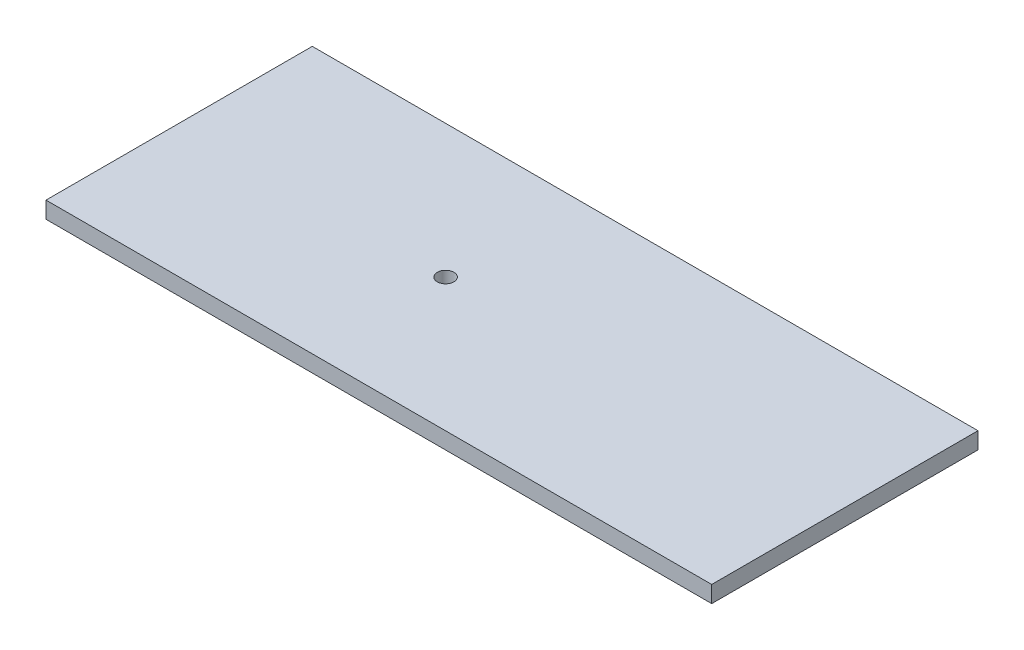
ISO-10303-21;
HEADER;
FILE_DESCRIPTION(('STEP AP214'),'2;1');
FILE_NAME('part.step','',(''),(''),'','','');
FILE_SCHEMA(('AUTOMOTIVE_DESIGN { 1 0 10303 214 1 1 1 1 }'));
ENDSEC;
DATA;
#1=APPLICATION_CONTEXT('core data for automotive mechanical design processes');
#2=APPLICATION_PROTOCOL_DEFINITION('international standard','automotive_design',2000,#1);
#3=PRODUCT_CONTEXT('',#1,'mechanical');
#4=PRODUCT('Part','Part','',(#3));
#5=PRODUCT_RELATED_PRODUCT_CATEGORY('part','',(#4));
#6=PRODUCT_DEFINITION_FORMATION('','',#4);
#7=PRODUCT_DEFINITION_CONTEXT('part definition',#1,'design');
#8=PRODUCT_DEFINITION('design','',#6,#7);
#9=PRODUCT_DEFINITION_SHAPE('','',#8);
#10=(LENGTH_UNIT() NAMED_UNIT(*) SI_UNIT(.MILLI.,.METRE.));
#11=(NAMED_UNIT(*) PLANE_ANGLE_UNIT() SI_UNIT($,.RADIAN.));
#12=(NAMED_UNIT(*) SI_UNIT($,.STERADIAN.) SOLID_ANGLE_UNIT());
#13=UNCERTAINTY_MEASURE_WITH_UNIT(LENGTH_MEASURE(1.E-05),#10,'distance_accuracy_value','');
#14=(GEOMETRIC_REPRESENTATION_CONTEXT(3) GLOBAL_UNCERTAINTY_ASSIGNED_CONTEXT((#13)) GLOBAL_UNIT_ASSIGNED_CONTEXT((#10,
#11,#12)) REPRESENTATION_CONTEXT('',''));
#15=CARTESIAN_POINT('',(0.,0.,0.));
#16=DIRECTION('',(0.,0.,1.));
#17=DIRECTION('',(1.,0.,0.));
#18=AXIS2_PLACEMENT_3D('',#15,#16,#17);
#19=CARTESIAN_POINT('',(762.,-38.1,-304.8));
#20=DIRECTION('',(1.,0.,0.));
#21=DIRECTION('',(0.,0.,-1.));
#22=AXIS2_PLACEMENT_3D('',#19,#20,#21);
#23=PLANE('',#22);
#24=DIRECTION('',(0.,0.,-1.));
#25=VECTOR('',#24,1.);
#26=CARTESIAN_POINT('',(762.,0.,-304.8));
#27=LINE('',#26,#25);
#28=CARTESIAN_POINT('',(762.,0.,304.8));
#29=VERTEX_POINT('',#28);
#30=CARTESIAN_POINT('',(762.,0.,-304.8));
#31=VERTEX_POINT('',#30);
#32=EDGE_CURVE('E116',#29,#31,#27,.T.);
#33=ORIENTED_EDGE('',*,*,#32,.F.);
#34=DIRECTION('',(0.,1.,0.));
#35=VECTOR('',#34,1.);
#36=CARTESIAN_POINT('',(762.,-38.1,304.8));
#37=LINE('',#36,#35);
#38=CARTESIAN_POINT('',(762.,-38.1,304.8));
#39=VERTEX_POINT('',#38);
#40=EDGE_CURVE('E11',#39,#29,#37,.T.);
#41=ORIENTED_EDGE('',*,*,#40,.F.);
#42=DIRECTION('',(0.,0.,-1.));
#43=VECTOR('',#42,1.);
#44=CARTESIAN_POINT('',(762.,-38.1,-304.8));
#45=LINE('',#44,#43);
#46=CARTESIAN_POINT('',(762.,-38.1,-304.8));
#47=VERTEX_POINT('',#46);
#48=EDGE_CURVE('E107',#39,#47,#45,.T.);
#49=ORIENTED_EDGE('',*,*,#48,.T.);
#50=DIRECTION('',(0.,1.,0.));
#51=VECTOR('',#50,1.);
#52=CARTESIAN_POINT('',(762.,-38.1,-304.8));
#53=LINE('',#52,#51);
#54=EDGE_CURVE('E48',#47,#31,#53,.T.);
#55=ORIENTED_EDGE('',*,*,#54,.T.);
#56=EDGE_LOOP('',(#33,#41,#49,#55));
#57=FACE_BOUND('',#56,.T.);
#58=ADVANCED_FACE('F45',(#57),#23,.T.);
#59=CARTESIAN_POINT('',(-762.,-38.1,304.8));
#60=DIRECTION('',(0.,0.,1.));
#61=DIRECTION('',(1.,0.,0.));
#62=AXIS2_PLACEMENT_3D('',#59,#60,#61);
#63=PLANE('',#62);
#64=DIRECTION('',(1.,0.,0.));
#65=VECTOR('',#64,1.);
#66=CARTESIAN_POINT('',(-762.,0.,304.8));
#67=LINE('',#66,#65);
#68=CARTESIAN_POINT('',(-762.,0.,304.8));
#69=VERTEX_POINT('',#68);
#70=EDGE_CURVE('E110',#69,#29,#67,.T.);
#71=ORIENTED_EDGE('',*,*,#70,.F.);
#72=DIRECTION('',(0.,1.,0.));
#73=VECTOR('',#72,1.);
#74=CARTESIAN_POINT('',(-762.,-38.1,304.8));
#75=LINE('',#74,#73);
#76=CARTESIAN_POINT('',(-762.,-38.1,304.8));
#77=VERTEX_POINT('',#76);
#78=EDGE_CURVE('E55',#77,#69,#75,.T.);
#79=ORIENTED_EDGE('',*,*,#78,.F.);
#80=DIRECTION('',(1.,0.,0.));
#81=VECTOR('',#80,1.);
#82=CARTESIAN_POINT('',(-762.,-38.1,304.8));
#83=LINE('',#82,#81);
#84=EDGE_CURVE('E102',#77,#39,#83,.T.);
#85=ORIENTED_EDGE('',*,*,#84,.T.);
#86=ORIENTED_EDGE('',*,*,#40,.T.);
#87=EDGE_LOOP('',(#71,#79,#85,#86));
#88=FACE_BOUND('',#87,.T.);
#89=ADVANCED_FACE('F133',(#88),#63,.T.);
#90=CARTESIAN_POINT('',(-762.,-38.1,-304.8));
#91=DIRECTION('',(-1.,0.,0.));
#92=DIRECTION('',(0.,0.,1.));
#93=AXIS2_PLACEMENT_3D('',#90,#91,#92);
#94=PLANE('',#93);
#95=DIRECTION('',(0.,0.,1.));
#96=VECTOR('',#95,1.);
#97=CARTESIAN_POINT('',(-762.,0.,-304.8));
#98=LINE('',#97,#96);
#99=CARTESIAN_POINT('',(-762.,0.,-304.8));
#100=VERTEX_POINT('',#99);
#101=EDGE_CURVE('E96',#100,#69,#98,.T.);
#102=ORIENTED_EDGE('',*,*,#101,.F.);
#103=DIRECTION('',(0.,1.,0.));
#104=VECTOR('',#103,1.);
#105=CARTESIAN_POINT('',(-762.,-38.1,-304.8));
#106=LINE('',#105,#104);
#107=CARTESIAN_POINT('',(-762.,-38.1,-304.8));
#108=VERTEX_POINT('',#107);
#109=EDGE_CURVE('E91',#108,#100,#106,.T.);
#110=ORIENTED_EDGE('',*,*,#109,.F.);
#111=DIRECTION('',(0.,0.,1.));
#112=VECTOR('',#111,1.);
#113=CARTESIAN_POINT('',(-762.,-38.1,-304.8));
#114=LINE('',#113,#112);
#115=EDGE_CURVE('E94',#108,#77,#114,.T.);
#116=ORIENTED_EDGE('',*,*,#115,.T.);
#117=ORIENTED_EDGE('',*,*,#78,.T.);
#118=EDGE_LOOP('',(#102,#110,#116,#117));
#119=FACE_BOUND('',#118,.T.);
#120=ADVANCED_FACE('F93',(#119),#94,.T.);
#121=CARTESIAN_POINT('',(-762.,-38.1,-304.8));
#122=DIRECTION('',(0.,0.,-1.));
#123=DIRECTION('',(-1.,0.,0.));
#124=AXIS2_PLACEMENT_3D('',#121,#122,#123);
#125=PLANE('',#124);
#126=DIRECTION('',(-1.,0.,0.));
#127=VECTOR('',#126,1.);
#128=CARTESIAN_POINT('',(-762.,0.,-304.8));
#129=LINE('',#128,#127);
#130=EDGE_CURVE('E120',#31,#100,#129,.T.);
#131=ORIENTED_EDGE('',*,*,#130,.F.);
#132=ORIENTED_EDGE('',*,*,#54,.F.);
#133=DIRECTION('',(-1.,0.,0.));
#134=VECTOR('',#133,1.);
#135=CARTESIAN_POINT('',(-762.,-38.1,-304.8));
#136=LINE('',#135,#134);
#137=EDGE_CURVE('E101',#47,#108,#136,.T.);
#138=ORIENTED_EDGE('',*,*,#137,.T.);
#139=ORIENTED_EDGE('',*,*,#109,.T.);
#140=EDGE_LOOP('',(#131,#132,#138,#139));
#141=FACE_BOUND('',#140,.T.);
#142=ADVANCED_FACE('F105',(#141),#125,.T.);
#143=CARTESIAN_POINT('',(0.,-38.1,0.));
#144=DIRECTION('',(0.,1.,0.));
#145=DIRECTION('',(0.,0.,1.));
#146=AXIS2_PLACEMENT_3D('',#143,#144,#145);
#147=PLANE('',#146);
#148=CARTESIAN_POINT('',(-152.,-38.1,0.));
#149=DIRECTION('',(0.,1.,0.));
#150=DIRECTION('',(0.,0.,1.));
#151=AXIS2_PLACEMENT_3D('',#148,#149,#150);
#152=CIRCLE('',#151,19.05);
#153=CARTESIAN_POINT('',(-152.,-38.1,19.05));
#154=VERTEX_POINT('',#153);
#155=EDGE_CURVE('E121',#154,#154,#152,.T.);
#156=ORIENTED_EDGE('',*,*,#155,.T.);
#157=EDGE_LOOP('',(#156));
#158=FACE_BOUND('',#157,.T.);
#159=ORIENTED_EDGE('',*,*,#48,.F.);
#160=ORIENTED_EDGE('',*,*,#84,.F.);
#161=ORIENTED_EDGE('',*,*,#115,.F.);
#162=ORIENTED_EDGE('',*,*,#137,.F.);
#163=EDGE_LOOP('',(#159,#160,#161,#162));
#164=FACE_BOUND('',#163,.T.);
#165=ADVANCED_FACE('F100',(#158,#164),#147,.F.);
#166=CARTESIAN_POINT('',(0.,0.,0.));
#167=DIRECTION('',(0.,1.,0.));
#168=DIRECTION('',(0.,0.,1.));
#169=AXIS2_PLACEMENT_3D('',#166,#167,#168);
#170=PLANE('',#169);
#171=CARTESIAN_POINT('',(-152.,0.,0.));
#172=DIRECTION('',(0.,1.,0.));
#173=DIRECTION('',(0.,0.,1.));
#174=AXIS2_PLACEMENT_3D('',#171,#172,#173);
#175=CIRCLE('',#174,19.05);
#176=CARTESIAN_POINT('',(-152.,0.,19.05));
#177=VERTEX_POINT('',#176);
#178=EDGE_CURVE('E163',#177,#177,#175,.T.);
#179=ORIENTED_EDGE('',*,*,#178,.F.);
#180=EDGE_LOOP('',(#179));
#181=FACE_BOUND('',#180,.T.);
#182=ORIENTED_EDGE('',*,*,#32,.T.);
#183=ORIENTED_EDGE('',*,*,#130,.T.);
#184=ORIENTED_EDGE('',*,*,#101,.T.);
#185=ORIENTED_EDGE('',*,*,#70,.T.);
#186=EDGE_LOOP('',(#182,#183,#184,#185));
#187=FACE_BOUND('',#186,.T.);
#188=ADVANCED_FACE('F132',(#181,#187),#170,.T.);
#189=CARTESIAN_POINT('',(-152.,-38.1,0.));
#190=DIRECTION('',(0.,1.,0.));
#191=DIRECTION('',(0.,0.,1.));
#192=AXIS2_PLACEMENT_3D('',#189,#190,#191);
#193=CYLINDRICAL_SURFACE('',#192,19.05);
#194=ORIENTED_EDGE('',*,*,#155,.F.);
#195=EDGE_LOOP('',(#194));
#196=FACE_BOUND('',#195,.T.);
#197=ORIENTED_EDGE('',*,*,#178,.T.);
#198=EDGE_LOOP('',(#197));
#199=FACE_BOUND('',#198,.T.);
#200=ADVANCED_FACE('F151',(#196,#199),#193,.F.);
#201=CLOSED_SHELL('',(#58,#89,#120,#142,#165,#188,#200));
#202=MANIFOLD_SOLID_BREP('B2',#201);
#203=ADVANCED_BREP_SHAPE_REPRESENTATION('',(#18,#202),#14);
#204=SHAPE_DEFINITION_REPRESENTATION(#9,#203);
ENDSEC;
END-ISO-10303-21;
